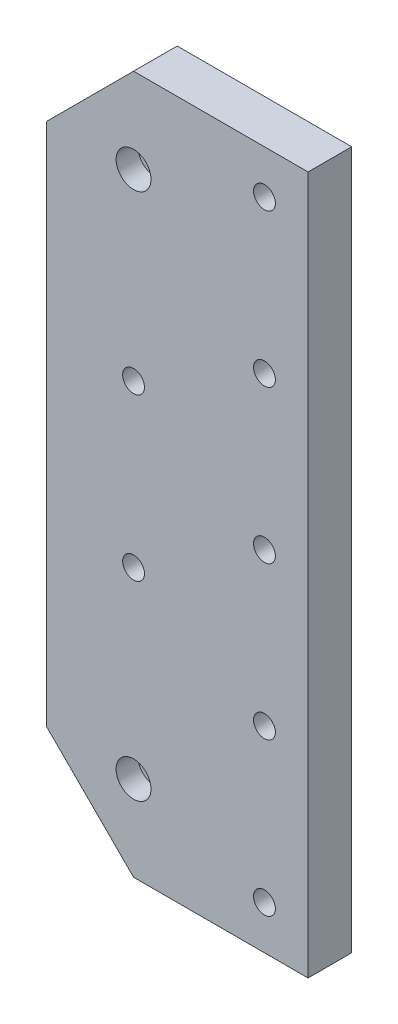
ISO-10303-21;
HEADER;
FILE_DESCRIPTION(('STEP AP214'),'2;1');
FILE_NAME('part.step','',(''),(''),'','','');
FILE_SCHEMA(('AUTOMOTIVE_DESIGN { 1 0 10303 214 1 1 1 1 }'));
ENDSEC;
DATA;
#1=APPLICATION_CONTEXT('core data for automotive mechanical design processes');
#2=APPLICATION_PROTOCOL_DEFINITION('international standard','automotive_design',2000,#1);
#3=PRODUCT_CONTEXT('',#1,'mechanical');
#4=PRODUCT('Part','Part','',(#3));
#5=PRODUCT_RELATED_PRODUCT_CATEGORY('part','',(#4));
#6=PRODUCT_DEFINITION_FORMATION('','',#4);
#7=PRODUCT_DEFINITION_CONTEXT('part definition',#1,'design');
#8=PRODUCT_DEFINITION('design','',#6,#7);
#9=PRODUCT_DEFINITION_SHAPE('','',#8);
#10=(LENGTH_UNIT() NAMED_UNIT(*) SI_UNIT(.MILLI.,.METRE.));
#11=(NAMED_UNIT(*) PLANE_ANGLE_UNIT() SI_UNIT($,.RADIAN.));
#12=(NAMED_UNIT(*) SI_UNIT($,.STERADIAN.) SOLID_ANGLE_UNIT());
#13=UNCERTAINTY_MEASURE_WITH_UNIT(LENGTH_MEASURE(1.E-05),#10,'distance_accuracy_value','');
#14=(GEOMETRIC_REPRESENTATION_CONTEXT(3) GLOBAL_UNCERTAINTY_ASSIGNED_CONTEXT((#13)) GLOBAL_UNIT_ASSIGNED_CONTEXT((#10,
#11,#12)) REPRESENTATION_CONTEXT('',''));
#15=CARTESIAN_POINT('',(0.,0.,0.));
#16=DIRECTION('',(0.,0.,1.));
#17=DIRECTION('',(1.,0.,0.));
#18=AXIS2_PLACEMENT_3D('',#15,#16,#17);
#19=CARTESIAN_POINT('',(-39.9399991072714,-27.9399039298296,10.));
#20=DIRECTION('',(0.,0.,-1.));
#21=DIRECTION('',(-1.,0.,0.));
#22=AXIS2_PLACEMENT_3D('',#19,#20,#21);
#23=CYLINDRICAL_SURFACE('',#22,4.);
#24=CARTESIAN_POINT('',(-39.9399991072714,-27.9399039298296,10.));
#25=DIRECTION('',(0.,0.,1.));
#26=DIRECTION('',(1.,0.,0.));
#27=AXIS2_PLACEMENT_3D('',#24,#25,#26);
#28=CIRCLE('',#27,4.);
#29=CARTESIAN_POINT('',(-35.9399991072714,-27.9399039298296,10.));
#30=VERTEX_POINT('',#29);
#31=EDGE_CURVE('E158',#30,#30,#28,.T.);
#32=ORIENTED_EDGE('',*,*,#31,.T.);
#33=EDGE_LOOP('',(#32));
#34=FACE_BOUND('',#33,.T.);
#35=CARTESIAN_POINT('',(-39.9399991072714,-27.9399039298296,5.));
#36=DIRECTION('',(0.,0.,-1.));
#37=DIRECTION('',(-1.,0.,0.));
#38=AXIS2_PLACEMENT_3D('',#35,#36,#37);
#39=CIRCLE('',#38,4.);
#40=CARTESIAN_POINT('',(-43.9399991072714,-27.9399039298296,5.));
#41=VERTEX_POINT('',#40);
#42=EDGE_CURVE('E170',#41,#41,#39,.T.);
#43=ORIENTED_EDGE('',*,*,#42,.T.);
#44=EDGE_LOOP('',(#43));
#45=FACE_BOUND('',#44,.T.);
#46=ADVANCED_FACE('F41',(#34,#45),#23,.F.);
#47=CARTESIAN_POINT('',(-39.9400177701366,93.0600937640756,10.));
#48=DIRECTION('',(0.,0.,-1.));
#49=DIRECTION('',(-1.,0.,0.));
#50=AXIS2_PLACEMENT_3D('',#47,#48,#49);
#51=CYLINDRICAL_SURFACE('',#50,4.);
#52=CARTESIAN_POINT('',(-39.9400177701366,93.0600937640756,10.));
#53=DIRECTION('',(0.,0.,1.));
#54=DIRECTION('',(1.,0.,0.));
#55=AXIS2_PLACEMENT_3D('',#52,#53,#54);
#56=CIRCLE('',#55,4.);
#57=CARTESIAN_POINT('',(-35.9400177701366,93.0600937640756,10.));
#58=VERTEX_POINT('',#57);
#59=EDGE_CURVE('E162',#58,#58,#56,.F.);
#60=ORIENTED_EDGE('',*,*,#59,.F.);
#61=EDGE_LOOP('',(#60));
#62=FACE_BOUND('',#61,.T.);
#63=CARTESIAN_POINT('',(-39.9400177701366,93.0600937640756,5.));
#64=DIRECTION('',(0.,0.,-1.));
#65=DIRECTION('',(-1.,0.,0.));
#66=AXIS2_PLACEMENT_3D('',#63,#64,#65);
#67=CIRCLE('',#66,4.);
#68=CARTESIAN_POINT('',(-43.9400177701366,93.0600937640756,5.));
#69=VERTEX_POINT('',#68);
#70=EDGE_CURVE('E11',#69,#69,#67,.F.);
#71=ORIENTED_EDGE('',*,*,#70,.F.);
#72=EDGE_LOOP('',(#71));
#73=FACE_BOUND('',#72,.T.);
#74=ADVANCED_FACE('F257',(#62,#73),#51,.F.);
#75=CARTESIAN_POINT('',(0.,112.560092657801,10.));
#76=DIRECTION('',(0.,1.,0.));
#77=DIRECTION('',(0.,0.,1.));
#78=AXIS2_PLACEMENT_3D('',#75,#76,#77);
#79=PLANE('',#78);
#80=DIRECTION('',(1.,0.,0.));
#81=VECTOR('',#80,1.);
#82=CARTESIAN_POINT('',(0.,112.560092657801,0.));
#83=LINE('',#82,#81);
#84=CARTESIAN_POINT('',(-39.9400009699181,112.560092657801,0.));
#85=VERTEX_POINT('',#84);
#86=CARTESIAN_POINT('',(0.0599999986704985,112.560092657801,0.));
#87=VERTEX_POINT('',#86);
#88=EDGE_CURVE('E166',#85,#87,#83,.T.);
#89=ORIENTED_EDGE('',*,*,#88,.F.);
#90=DIRECTION('',(0.,0.,-1.));
#91=VECTOR('',#90,1.);
#92=CARTESIAN_POINT('',(-39.9400009699181,112.560092657801,10.));
#93=LINE('',#92,#91);
#94=CARTESIAN_POINT('',(-39.9400009699181,112.560092657801,10.));
#95=VERTEX_POINT('',#94);
#96=EDGE_CURVE('E51',#95,#85,#93,.T.);
#97=ORIENTED_EDGE('',*,*,#96,.F.);
#98=DIRECTION('',(1.,0.,0.));
#99=VECTOR('',#98,1.);
#100=CARTESIAN_POINT('',(0.,112.560092657801,10.));
#101=LINE('',#100,#99);
#102=CARTESIAN_POINT('',(0.0599999986704985,112.560092657801,10.));
#103=VERTEX_POINT('',#102);
#104=EDGE_CURVE('E215',#95,#103,#101,.T.);
#105=ORIENTED_EDGE('',*,*,#104,.T.);
#106=DIRECTION('',(0.,0.,-1.));
#107=VECTOR('',#106,1.);
#108=CARTESIAN_POINT('',(0.0599999986704985,112.560092657801,10.));
#109=LINE('',#108,#107);
#110=EDGE_CURVE('E59',#103,#87,#109,.T.);
#111=ORIENTED_EDGE('',*,*,#110,.T.);
#112=EDGE_LOOP('',(#89,#97,#105,#111));
#113=FACE_BOUND('',#112,.T.);
#114=ADVANCED_FACE('F43',(#113),#79,.T.);
#115=CARTESIAN_POINT('',(-76.2500468138595,76.2500468138596,10.));
#116=DIRECTION('',(-0.707106781186547,0.707106781186548,0.));
#117=DIRECTION('',(-0.707106781186548,-0.707106781186547,0.));
#118=AXIS2_PLACEMENT_3D('',#115,#116,#117);
#119=PLANE('',#118);
#120=DIRECTION('',(0.707106781186548,0.707106781186547,0.));
#121=VECTOR('',#120,1.);
#122=CARTESIAN_POINT('',(-76.2500468138595,76.2500468138596,0.));
#123=LINE('',#122,#121);
#124=CARTESIAN_POINT('',(-59.9399986602347,92.5600949674845,0.));
#125=VERTEX_POINT('',#124);
#126=EDGE_CURVE('E169',#125,#85,#123,.T.);
#127=ORIENTED_EDGE('',*,*,#126,.F.);
#128=DIRECTION('',(0.,0.,-1.));
#129=VECTOR('',#128,1.);
#130=CARTESIAN_POINT('',(-59.9399986602347,92.5600949674845,10.));
#131=LINE('',#130,#129);
#132=CARTESIAN_POINT('',(-59.9399986602347,92.5600949674845,10.));
#133=VERTEX_POINT('',#132);
#134=EDGE_CURVE('E222',#133,#125,#131,.T.);
#135=ORIENTED_EDGE('',*,*,#134,.F.);
#136=DIRECTION('',(0.707106781186548,0.707106781186547,0.));
#137=VECTOR('',#136,1.);
#138=CARTESIAN_POINT('',(-76.2500468138595,76.2500468138596,10.));
#139=LINE('',#138,#137);
#140=EDGE_CURVE('E229',#133,#95,#139,.T.);
#141=ORIENTED_EDGE('',*,*,#140,.T.);
#142=ORIENTED_EDGE('',*,*,#96,.T.);
#143=EDGE_LOOP('',(#127,#135,#141,#142));
#144=FACE_BOUND('',#143,.T.);
#145=ADVANCED_FACE('F228',(#144),#119,.T.);
#146=CARTESIAN_POINT('',(-59.9399986602347,0.,10.));
#147=DIRECTION('',(-1.,0.,0.));
#148=DIRECTION('',(0.,0.,1.));
#149=AXIS2_PLACEMENT_3D('',#146,#147,#148);
#150=PLANE('',#149);
#151=DIRECTION('',(0.,1.,0.));
#152=VECTOR('',#151,1.);
#153=CARTESIAN_POINT('',(-59.9399986602347,0.,0.));
#154=LINE('',#153,#152);
#155=CARTESIAN_POINT('',(-59.9399986602347,-27.4399060755975,0.));
#156=VERTEX_POINT('',#155);
#157=EDGE_CURVE('E174',#156,#125,#154,.T.);
#158=ORIENTED_EDGE('',*,*,#157,.F.);
#159=DIRECTION('',(0.,0.,-1.));
#160=VECTOR('',#159,1.);
#161=CARTESIAN_POINT('',(-59.9399986602347,-27.4399060755975,10.));
#162=LINE('',#161,#160);
#163=CARTESIAN_POINT('',(-59.9399986602347,-27.4399060755975,10.));
#164=VERTEX_POINT('',#163);
#165=EDGE_CURVE('E120',#164,#156,#162,.T.);
#166=ORIENTED_EDGE('',*,*,#165,.F.);
#167=DIRECTION('',(0.,1.,0.));
#168=VECTOR('',#167,1.);
#169=CARTESIAN_POINT('',(-59.9399986602347,0.,10.));
#170=LINE('',#169,#168);
#171=EDGE_CURVE('E108',#164,#133,#170,.T.);
#172=ORIENTED_EDGE('',*,*,#171,.T.);
#173=ORIENTED_EDGE('',*,*,#134,.T.);
#174=EDGE_LOOP('',(#158,#166,#172,#173));
#175=FACE_BOUND('',#174,.T.);
#176=ADVANCED_FACE('F235',(#175),#150,.T.);
#177=CARTESIAN_POINT('',(-43.689952367918,-43.6899523679152,10.));
#178=DIRECTION('',(0.70710678118657,0.707106781186525,0.));
#179=DIRECTION('',(-0.707106781186525,0.70710678118657,0.));
#180=AXIS2_PLACEMENT_3D('',#177,#178,#179);
#181=PLANE('',#180);
#182=DIRECTION('',(0.707106781186525,-0.70710678118657,0.));
#183=VECTOR('',#182,1.);
#184=CARTESIAN_POINT('',(-43.689952367918,-43.6899523679152,0.));
#185=LINE('',#184,#183);
#186=CARTESIAN_POINT('',(-39.9399991072727,-47.4399056285607,0.));
#187=VERTEX_POINT('',#186);
#188=EDGE_CURVE('E116',#156,#187,#185,.T.);
#189=ORIENTED_EDGE('',*,*,#188,.T.);
#190=DIRECTION('',(0.,0.,-1.));
#191=VECTOR('',#190,1.);
#192=CARTESIAN_POINT('',(-39.9399991072727,-47.4399056285607,10.));
#193=LINE('',#192,#191);
#194=CARTESIAN_POINT('',(-39.9399991072727,-47.4399056285607,10.));
#195=VERTEX_POINT('',#194);
#196=EDGE_CURVE('E113',#195,#187,#193,.T.);
#197=ORIENTED_EDGE('',*,*,#196,.F.);
#198=DIRECTION('',(0.707106781186525,-0.70710678118657,0.));
#199=VECTOR('',#198,1.);
#200=CARTESIAN_POINT('',(-43.689952367918,-43.6899523679152,10.));
#201=LINE('',#200,#199);
#202=EDGE_CURVE('E99',#164,#195,#201,.T.);
#203=ORIENTED_EDGE('',*,*,#202,.F.);
#204=ORIENTED_EDGE('',*,*,#165,.T.);
#205=EDGE_LOOP('',(#189,#197,#203,#204));
#206=FACE_BOUND('',#205,.T.);
#207=ADVANCED_FACE('F114',(#206),#181,.F.);
#208=CARTESIAN_POINT('',(0.,-47.4399056285607,10.));
#209=DIRECTION('',(0.,-1.,0.));
#210=DIRECTION('',(1.,0.,0.));
#211=AXIS2_PLACEMENT_3D('',#208,#209,#210);
#212=PLANE('',#211);
#213=DIRECTION('',(-1.,0.,0.));
#214=VECTOR('',#213,1.);
#215=CARTESIAN_POINT('',(0.,-47.4399056285607,0.));
#216=LINE('',#215,#214);
#217=CARTESIAN_POINT('',(0.0599999986705193,-47.4399056285607,0.));
#218=VERTEX_POINT('',#217);
#219=EDGE_CURVE('E180',#218,#187,#216,.T.);
#220=ORIENTED_EDGE('',*,*,#219,.F.);
#221=DIRECTION('',(0.,0.,-1.));
#222=VECTOR('',#221,1.);
#223=CARTESIAN_POINT('',(0.0599999986705193,-47.4399056285607,10.));
#224=LINE('',#223,#222);
#225=CARTESIAN_POINT('',(0.0599999986705193,-47.4399056285607,10.));
#226=VERTEX_POINT('',#225);
#227=EDGE_CURVE('E79',#226,#218,#224,.T.);
#228=ORIENTED_EDGE('',*,*,#227,.F.);
#229=DIRECTION('',(-1.,0.,0.));
#230=VECTOR('',#229,1.);
#231=CARTESIAN_POINT('',(0.,-47.4399056285607,10.));
#232=LINE('',#231,#230);
#233=EDGE_CURVE('E105',#226,#195,#232,.T.);
#234=ORIENTED_EDGE('',*,*,#233,.T.);
#235=ORIENTED_EDGE('',*,*,#196,.T.);
#236=EDGE_LOOP('',(#220,#228,#234,#235));
#237=FACE_BOUND('',#236,.T.);
#238=ADVANCED_FACE('F122',(#237),#212,.T.);
#239=CARTESIAN_POINT('',(-9.93999791517853,-37.4399056192488,10.));
#240=DIRECTION('',(0.,0.,-1.));
#241=DIRECTION('',(-1.,0.,0.));
#242=AXIS2_PLACEMENT_3D('',#239,#240,#241);
#243=CYLINDRICAL_SURFACE('',#242,2.50000017695129);
#244=CARTESIAN_POINT('',(-9.93999791517853,-37.4399056192488,10.));
#245=DIRECTION('',(0.,0.,1.));
#246=DIRECTION('',(1.,0.,0.));
#247=AXIS2_PLACEMENT_3D('',#244,#245,#246);
#248=CIRCLE('',#247,2.50000017695129);
#249=CARTESIAN_POINT('',(-7.43999773822724,-37.4399056192488,10.));
#250=VERTEX_POINT('',#249);
#251=EDGE_CURVE('E154',#250,#250,#248,.T.);
#252=ORIENTED_EDGE('',*,*,#251,.T.);
#253=EDGE_LOOP('',(#252));
#254=FACE_BOUND('',#253,.T.);
#255=CARTESIAN_POINT('',(-9.93999791517853,-37.4399056192488,0.));
#256=DIRECTION('',(0.,0.,1.));
#257=DIRECTION('',(1.,0.,0.));
#258=AXIS2_PLACEMENT_3D('',#255,#256,#257);
#259=CIRCLE('',#258,2.50000017695129);
#260=CARTESIAN_POINT('',(-7.43999773822724,-37.4399056192488,0.));
#261=VERTEX_POINT('',#260);
#262=EDGE_CURVE('E211',#261,#261,#259,.T.);
#263=ORIENTED_EDGE('',*,*,#262,.F.);
#264=EDGE_LOOP('',(#263));
#265=FACE_BOUND('',#264,.T.);
#266=ADVANCED_FACE('F267',(#254,#265),#243,.F.);
#267=CARTESIAN_POINT('',(-9.93999791517853,-2.43990570306779,10.));
#268=DIRECTION('',(0.,0.,-1.));
#269=DIRECTION('',(-1.,0.,0.));
#270=AXIS2_PLACEMENT_3D('',#267,#268,#269);
#271=CYLINDRICAL_SURFACE('',#270,2.49999992418065);
#272=CARTESIAN_POINT('',(-9.93999791517853,-2.43990570306779,10.));
#273=DIRECTION('',(0.,0.,1.));
#274=DIRECTION('',(1.,0.,0.));
#275=AXIS2_PLACEMENT_3D('',#272,#273,#274);
#276=CIRCLE('',#275,2.49999992418065);
#277=CARTESIAN_POINT('',(-7.43999799099788,-2.43990570306779,10.));
#278=VERTEX_POINT('',#277);
#279=EDGE_CURVE('E150',#278,#278,#276,.T.);
#280=ORIENTED_EDGE('',*,*,#279,.T.);
#281=EDGE_LOOP('',(#280));
#282=FACE_BOUND('',#281,.T.);
#283=CARTESIAN_POINT('',(-9.93999791517853,-2.43990570306779,0.));
#284=DIRECTION('',(0.,0.,1.));
#285=DIRECTION('',(1.,0.,0.));
#286=AXIS2_PLACEMENT_3D('',#283,#284,#285);
#287=CIRCLE('',#286,2.49999992418065);
#288=CARTESIAN_POINT('',(-7.43999799099788,-2.43990570306779,0.));
#289=VERTEX_POINT('',#288);
#290=EDGE_CURVE('E207',#289,#289,#287,.T.);
#291=ORIENTED_EDGE('',*,*,#290,.F.);
#292=EDGE_LOOP('',(#291));
#293=FACE_BOUND('',#292,.T.);
#294=ADVANCED_FACE('F270',(#282,#293),#271,.F.);
#295=CARTESIAN_POINT('',(-39.9399991072714,14.0600960701704,10.));
#296=DIRECTION('',(0.,0.,-1.));
#297=DIRECTION('',(-1.,0.,0.));
#298=AXIS2_PLACEMENT_3D('',#295,#296,#297);
#299=CYLINDRICAL_SURFACE('',#298,2.5000013411045);
#300=CARTESIAN_POINT('',(-39.9399991072714,14.0600960701704,10.));
#301=DIRECTION('',(0.,0.,1.));
#302=DIRECTION('',(1.,0.,0.));
#303=AXIS2_PLACEMENT_3D('',#300,#301,#302);
#304=CIRCLE('',#303,2.5000013411045);
#305=CARTESIAN_POINT('',(-37.4399977661669,14.0600960701704,10.));
#306=VERTEX_POINT('',#305);
#307=EDGE_CURVE('E146',#306,#306,#304,.T.);
#308=ORIENTED_EDGE('',*,*,#307,.T.);
#309=EDGE_LOOP('',(#308));
#310=FACE_BOUND('',#309,.T.);
#311=CARTESIAN_POINT('',(-39.9399991072714,14.0600960701704,0.));
#312=DIRECTION('',(0.,0.,1.));
#313=DIRECTION('',(1.,0.,0.));
#314=AXIS2_PLACEMENT_3D('',#311,#312,#313);
#315=CIRCLE('',#314,2.5000013411045);
#316=CARTESIAN_POINT('',(-37.4399977661669,14.0600960701704,0.));
#317=VERTEX_POINT('',#316);
#318=EDGE_CURVE('E203',#317,#317,#315,.T.);
#319=ORIENTED_EDGE('',*,*,#318,.F.);
#320=EDGE_LOOP('',(#319));
#321=FACE_BOUND('',#320,.T.);
#322=ADVANCED_FACE('F274',(#310,#321),#299,.F.);
#323=CARTESIAN_POINT('',(-39.9399991072714,51.0600928217172,10.));
#324=DIRECTION('',(0.,0.,-1.));
#325=DIRECTION('',(-1.,0.,0.));
#326=AXIS2_PLACEMENT_3D('',#323,#324,#325);
#327=CYLINDRICAL_SURFACE('',#326,2.50000052274069);
#328=CARTESIAN_POINT('',(-39.9399991072714,51.0600928217172,10.));
#329=DIRECTION('',(0.,0.,1.));
#330=DIRECTION('',(1.,0.,0.));
#331=AXIS2_PLACEMENT_3D('',#328,#329,#330);
#332=CIRCLE('',#331,2.50000052274069);
#333=CARTESIAN_POINT('',(-37.4399985845307,51.0600928217172,10.));
#334=VERTEX_POINT('',#333);
#335=EDGE_CURVE('E142',#334,#334,#332,.T.);
#336=ORIENTED_EDGE('',*,*,#335,.T.);
#337=EDGE_LOOP('',(#336));
#338=FACE_BOUND('',#337,.T.);
#339=CARTESIAN_POINT('',(-39.9399991072714,51.0600928217172,0.));
#340=DIRECTION('',(0.,0.,1.));
#341=DIRECTION('',(1.,0.,0.));
#342=AXIS2_PLACEMENT_3D('',#339,#340,#341);
#343=CIRCLE('',#342,2.50000052274069);
#344=CARTESIAN_POINT('',(-37.4399985845307,51.0600928217172,0.));
#345=VERTEX_POINT('',#344);
#346=EDGE_CURVE('E199',#345,#345,#343,.T.);
#347=ORIENTED_EDGE('',*,*,#346,.F.);
#348=EDGE_LOOP('',(#347));
#349=FACE_BOUND('',#348,.T.);
#350=ADVANCED_FACE('F278',(#338,#349),#327,.F.);
#351=CARTESIAN_POINT('',(-9.93999977782418,32.5600995442811,10.));
#352=DIRECTION('',(0.,0.,-1.));
#353=DIRECTION('',(-1.,0.,0.));
#354=AXIS2_PLACEMENT_3D('',#351,#352,#353);
#355=CYLINDRICAL_SURFACE('',#354,2.50000008366697);
#356=CARTESIAN_POINT('',(-9.93999977782418,32.5600995442811,10.));
#357=DIRECTION('',(0.,0.,1.));
#358=DIRECTION('',(1.,0.,0.));
#359=AXIS2_PLACEMENT_3D('',#356,#357,#358);
#360=CIRCLE('',#359,2.50000008366697);
#361=CARTESIAN_POINT('',(-7.43999969415721,32.5600995442811,10.));
#362=VERTEX_POINT('',#361);
#363=EDGE_CURVE('E138',#362,#362,#360,.T.);
#364=ORIENTED_EDGE('',*,*,#363,.T.);
#365=EDGE_LOOP('',(#364));
#366=FACE_BOUND('',#365,.T.);
#367=CARTESIAN_POINT('',(-9.93999977782418,32.5600995442811,0.));
#368=DIRECTION('',(0.,0.,1.));
#369=DIRECTION('',(1.,0.,0.));
#370=AXIS2_PLACEMENT_3D('',#367,#368,#369);
#371=CIRCLE('',#370,2.50000008366697);
#372=CARTESIAN_POINT('',(-7.43999969415721,32.5600995442811,0.));
#373=VERTEX_POINT('',#372);
#374=EDGE_CURVE('E195',#373,#373,#371,.T.);
#375=ORIENTED_EDGE('',*,*,#374,.F.);
#376=EDGE_LOOP('',(#375));
#377=FACE_BOUND('',#376,.T.);
#378=ADVANCED_FACE('F282',(#366,#377),#355,.F.);
#379=CARTESIAN_POINT('',(-9.93999977782368,67.5600927323103,10.));
#380=DIRECTION('',(0.,0.,-1.));
#381=DIRECTION('',(-1.,0.,0.));
#382=AXIS2_PLACEMENT_3D('',#379,#380,#381);
#383=CYLINDRICAL_SURFACE('',#382,2.49999841128201);
#384=CARTESIAN_POINT('',(-9.93999977782368,67.5600927323103,10.));
#385=DIRECTION('',(0.,0.,1.));
#386=DIRECTION('',(1.,0.,0.));
#387=AXIS2_PLACEMENT_3D('',#384,#385,#386);
#388=CIRCLE('',#387,2.49999841128201);
#389=CARTESIAN_POINT('',(-7.44000136654167,67.5600927323103,10.));
#390=VERTEX_POINT('',#389);
#391=EDGE_CURVE('E134',#390,#390,#388,.T.);
#392=ORIENTED_EDGE('',*,*,#391,.T.);
#393=EDGE_LOOP('',(#392));
#394=FACE_BOUND('',#393,.T.);
#395=CARTESIAN_POINT('',(-9.93999977782368,67.5600927323103,0.));
#396=DIRECTION('',(0.,0.,1.));
#397=DIRECTION('',(1.,0.,0.));
#398=AXIS2_PLACEMENT_3D('',#395,#396,#397);
#399=CIRCLE('',#398,2.49999841128201);
#400=CARTESIAN_POINT('',(-7.44000136654167,67.5600927323103,0.));
#401=VERTEX_POINT('',#400);
#402=EDGE_CURVE('E191',#401,#401,#399,.T.);
#403=ORIENTED_EDGE('',*,*,#402,.F.);
#404=EDGE_LOOP('',(#403));
#405=FACE_BOUND('',#404,.T.);
#406=ADVANCED_FACE('F286',(#394,#405),#383,.F.);
#407=CARTESIAN_POINT('',(-9.93999977782368,102.560092881322,10.));
#408=DIRECTION('',(0.,0.,-1.));
#409=DIRECTION('',(-1.,0.,0.));
#410=AXIS2_PLACEMENT_3D('',#407,#408,#409);
#411=CYLINDRICAL_SURFACE('',#410,2.50000362250855);
#412=CARTESIAN_POINT('',(-9.93999977782368,102.560092881322,10.));
#413=DIRECTION('',(0.,0.,1.));
#414=DIRECTION('',(1.,0.,0.));
#415=AXIS2_PLACEMENT_3D('',#412,#413,#414);
#416=CIRCLE('',#415,2.50000362250855);
#417=CARTESIAN_POINT('',(-7.43999615531513,102.560092881322,10.));
#418=VERTEX_POINT('',#417);
#419=EDGE_CURVE('E127',#418,#418,#416,.T.);
#420=ORIENTED_EDGE('',*,*,#419,.T.);
#421=EDGE_LOOP('',(#420));
#422=FACE_BOUND('',#421,.T.);
#423=CARTESIAN_POINT('',(-9.93999977782368,102.560092881322,0.));
#424=DIRECTION('',(0.,0.,1.));
#425=DIRECTION('',(1.,0.,0.));
#426=AXIS2_PLACEMENT_3D('',#423,#424,#425);
#427=CIRCLE('',#426,2.50000362250855);
#428=CARTESIAN_POINT('',(-7.43999615531513,102.560092881322,0.));
#429=VERTEX_POINT('',#428);
#430=EDGE_CURVE('E187',#429,#429,#427,.T.);
#431=ORIENTED_EDGE('',*,*,#430,.F.);
#432=EDGE_LOOP('',(#431));
#433=FACE_BOUND('',#432,.T.);
#434=ADVANCED_FACE('F290',(#422,#433),#411,.F.);
#435=CARTESIAN_POINT('',(0.0599999986705131,0.,10.));
#436=DIRECTION('',(1.,0.,0.));
#437=DIRECTION('',(0.,1.,0.));
#438=AXIS2_PLACEMENT_3D('',#435,#436,#437);
#439=PLANE('',#438);
#440=DIRECTION('',(0.,-1.,0.));
#441=VECTOR('',#440,1.);
#442=CARTESIAN_POINT('',(0.0599999986705131,0.,0.));
#443=LINE('',#442,#441);
#444=EDGE_CURVE('E183',#87,#218,#443,.T.);
#445=ORIENTED_EDGE('',*,*,#444,.F.);
#446=ORIENTED_EDGE('',*,*,#110,.F.);
#447=DIRECTION('',(0.,-1.,0.));
#448=VECTOR('',#447,1.);
#449=CARTESIAN_POINT('',(0.0599999986705131,0.,10.));
#450=LINE('',#449,#448);
#451=EDGE_CURVE('E124',#103,#226,#450,.T.);
#452=ORIENTED_EDGE('',*,*,#451,.T.);
#453=ORIENTED_EDGE('',*,*,#227,.T.);
#454=EDGE_LOOP('',(#445,#446,#452,#453));
#455=FACE_BOUND('',#454,.T.);
#456=ADVANCED_FACE('F294',(#455),#439,.T.);
#457=CARTESIAN_POINT('',(0.,0.,10.));
#458=DIRECTION('',(0.,0.,1.));
#459=DIRECTION('',(1.,0.,0.));
#460=AXIS2_PLACEMENT_3D('',#457,#458,#459);
#461=PLANE('',#460);
#462=ORIENTED_EDGE('',*,*,#104,.F.);
#463=ORIENTED_EDGE('',*,*,#140,.F.);
#464=ORIENTED_EDGE('',*,*,#171,.F.);
#465=ORIENTED_EDGE('',*,*,#202,.T.);
#466=ORIENTED_EDGE('',*,*,#233,.F.);
#467=ORIENTED_EDGE('',*,*,#451,.F.);
#468=EDGE_LOOP('',(#462,#463,#464,#465,#466,#467));
#469=FACE_BOUND('',#468,.T.);
#470=ORIENTED_EDGE('',*,*,#419,.F.);
#471=EDGE_LOOP('',(#470));
#472=FACE_BOUND('',#471,.T.);
#473=ORIENTED_EDGE('',*,*,#391,.F.);
#474=EDGE_LOOP('',(#473));
#475=FACE_BOUND('',#474,.T.);
#476=ORIENTED_EDGE('',*,*,#363,.F.);
#477=EDGE_LOOP('',(#476));
#478=FACE_BOUND('',#477,.T.);
#479=ORIENTED_EDGE('',*,*,#335,.F.);
#480=EDGE_LOOP('',(#479));
#481=FACE_BOUND('',#480,.T.);
#482=ORIENTED_EDGE('',*,*,#307,.F.);
#483=EDGE_LOOP('',(#482));
#484=FACE_BOUND('',#483,.T.);
#485=ORIENTED_EDGE('',*,*,#279,.F.);
#486=EDGE_LOOP('',(#485));
#487=FACE_BOUND('',#486,.T.);
#488=ORIENTED_EDGE('',*,*,#251,.F.);
#489=EDGE_LOOP('',(#488));
#490=FACE_BOUND('',#489,.T.);
#491=ORIENTED_EDGE('',*,*,#31,.F.);
#492=EDGE_LOOP('',(#491));
#493=FACE_BOUND('',#492,.T.);
#494=ORIENTED_EDGE('',*,*,#59,.T.);
#495=EDGE_LOOP('',(#494));
#496=FACE_BOUND('',#495,.T.);
#497=ADVANCED_FACE('F101',(#469,#472,#475,#478,#481,#484,#487,#490,#493,#496),#461,.T.);
#498=CARTESIAN_POINT('',(0.,0.,0.));
#499=DIRECTION('',(0.,0.,1.));
#500=DIRECTION('',(1.,0.,0.));
#501=AXIS2_PLACEMENT_3D('',#498,#499,#500);
#502=PLANE('',#501);
#503=ORIENTED_EDGE('',*,*,#88,.T.);
#504=ORIENTED_EDGE('',*,*,#444,.T.);
#505=ORIENTED_EDGE('',*,*,#219,.T.);
#506=ORIENTED_EDGE('',*,*,#188,.F.);
#507=ORIENTED_EDGE('',*,*,#157,.T.);
#508=ORIENTED_EDGE('',*,*,#126,.T.);
#509=EDGE_LOOP('',(#503,#504,#505,#506,#507,#508));
#510=FACE_BOUND('',#509,.T.);
#511=ORIENTED_EDGE('',*,*,#430,.T.);
#512=EDGE_LOOP('',(#511));
#513=FACE_BOUND('',#512,.T.);
#514=ORIENTED_EDGE('',*,*,#402,.T.);
#515=EDGE_LOOP('',(#514));
#516=FACE_BOUND('',#515,.T.);
#517=ORIENTED_EDGE('',*,*,#374,.T.);
#518=EDGE_LOOP('',(#517));
#519=FACE_BOUND('',#518,.T.);
#520=ORIENTED_EDGE('',*,*,#346,.T.);
#521=EDGE_LOOP('',(#520));
#522=FACE_BOUND('',#521,.T.);
#523=ORIENTED_EDGE('',*,*,#318,.T.);
#524=EDGE_LOOP('',(#523));
#525=FACE_BOUND('',#524,.T.);
#526=ORIENTED_EDGE('',*,*,#290,.T.);
#527=EDGE_LOOP('',(#526));
#528=FACE_BOUND('',#527,.T.);
#529=ORIENTED_EDGE('',*,*,#262,.T.);
#530=EDGE_LOOP('',(#529));
#531=FACE_BOUND('',#530,.T.);
#532=ADVANCED_FACE('F231',(#510,#513,#516,#519,#522,#525,#528,#531),#502,.F.);
#533=CARTESIAN_POINT('',(-39.9400177701366,93.0600937640756,5.));
#534=DIRECTION('',(0.,0.,-1.));
#535=DIRECTION('',(-1.,0.,0.));
#536=AXIS2_PLACEMENT_3D('',#533,#534,#535);
#537=PLANE('',#536);
#538=ORIENTED_EDGE('',*,*,#70,.T.);
#539=EDGE_LOOP('',(#538));
#540=FACE_BOUND('',#539,.T.);
#541=ADVANCED_FACE('F249',(#540),#537,.F.);
#542=CARTESIAN_POINT('',(-39.9399991072714,-27.9399039298296,5.));
#543=DIRECTION('',(0.,0.,-1.));
#544=DIRECTION('',(-1.,0.,0.));
#545=AXIS2_PLACEMENT_3D('',#542,#543,#544);
#546=PLANE('',#545);
#547=ORIENTED_EDGE('',*,*,#42,.F.);
#548=EDGE_LOOP('',(#547));
#549=FACE_BOUND('',#548,.T.);
#550=ADVANCED_FACE('F247',(#549),#546,.F.);
#551=CLOSED_SHELL('',(#46,#74,#114,#145,#176,#207,#238,#266,#294,#322,#350,#378,#406,#434,#456,
#497,#532,#541,#550));
#552=MANIFOLD_SOLID_BREP('B2',#551);
#553=ADVANCED_BREP_SHAPE_REPRESENTATION('',(#18,#552),#14);
#554=SHAPE_DEFINITION_REPRESENTATION(#9,#553);
ENDSEC;
END-ISO-10303-21;
